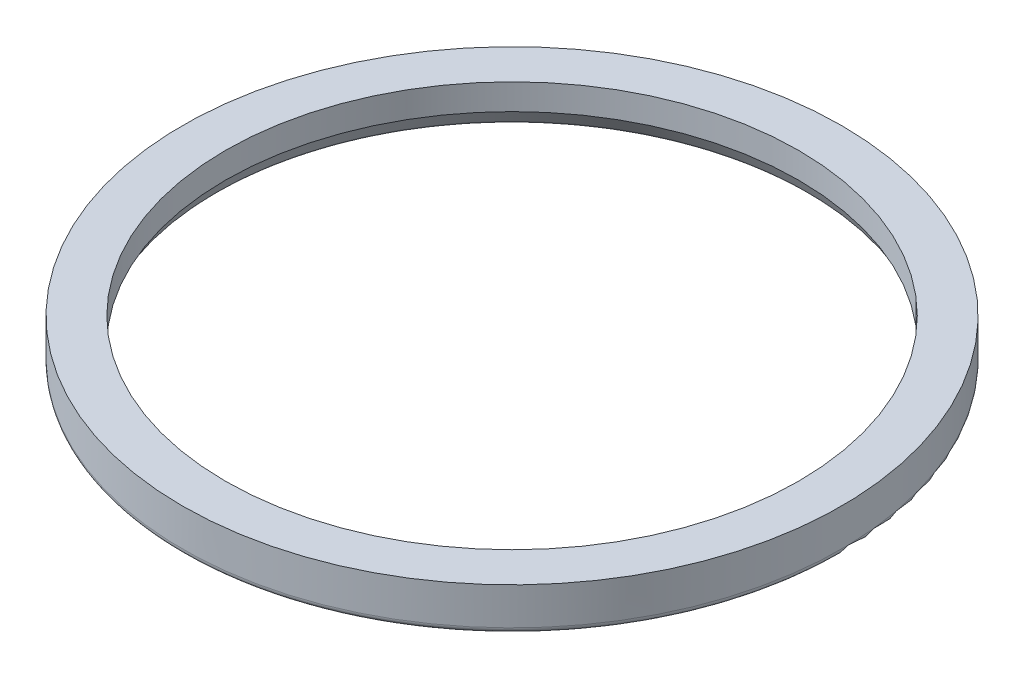
ISO-10303-21;
HEADER;
FILE_DESCRIPTION(('STEP AP214'),'2;1');
FILE_NAME('part.step','',(''),(''),'','','');
FILE_SCHEMA(('AUTOMOTIVE_DESIGN { 1 0 10303 214 1 1 1 1 }'));
ENDSEC;
DATA;
#1=APPLICATION_CONTEXT('core data for automotive mechanical design processes');
#2=APPLICATION_PROTOCOL_DEFINITION('international standard','automotive_design',2000,#1);
#3=PRODUCT_CONTEXT('',#1,'mechanical');
#4=PRODUCT('Part','Part','',(#3));
#5=PRODUCT_RELATED_PRODUCT_CATEGORY('part','',(#4));
#6=PRODUCT_DEFINITION_FORMATION('','',#4);
#7=PRODUCT_DEFINITION_CONTEXT('part definition',#1,'design');
#8=PRODUCT_DEFINITION('design','',#6,#7);
#9=PRODUCT_DEFINITION_SHAPE('','',#8);
#10=(LENGTH_UNIT() NAMED_UNIT(*) SI_UNIT(.MILLI.,.METRE.));
#11=(NAMED_UNIT(*) PLANE_ANGLE_UNIT() SI_UNIT($,.RADIAN.));
#12=(NAMED_UNIT(*) SI_UNIT($,.STERADIAN.) SOLID_ANGLE_UNIT());
#13=UNCERTAINTY_MEASURE_WITH_UNIT(LENGTH_MEASURE(1.E-05),#10,'distance_accuracy_value','');
#14=(GEOMETRIC_REPRESENTATION_CONTEXT(3) GLOBAL_UNCERTAINTY_ASSIGNED_CONTEXT((#13)) GLOBAL_UNIT_ASSIGNED_CONTEXT((#10,
#11,#12)) REPRESENTATION_CONTEXT('',''));
#15=CARTESIAN_POINT('',(0.,0.,0.));
#16=DIRECTION('',(0.,0.,1.));
#17=DIRECTION('',(1.,0.,0.));
#18=AXIS2_PLACEMENT_3D('',#15,#16,#17);
#19=CARTESIAN_POINT('',(0.,-132.,0.));
#20=DIRECTION('',(0.,-1.,0.));
#21=DIRECTION('',(0.,0.,-1.));
#22=AXIS2_PLACEMENT_3D('',#19,#20,#21);
#23=CYLINDRICAL_SURFACE('',#22,115.);
#24=CARTESIAN_POINT('',(0.,-132.,0.));
#25=DIRECTION('',(0.,1.,0.));
#26=DIRECTION('',(0.,0.,-1.));
#27=AXIS2_PLACEMENT_3D('',#24,#25,#26);
#28=CIRCLE('',#27,115.);
#29=CARTESIAN_POINT('',(0.,-132.,115.));
#30=VERTEX_POINT('',#29);
#31=EDGE_CURVE('E27',#30,#30,#28,.T.);
#32=ORIENTED_EDGE('',*,*,#31,.F.);
#33=EDGE_LOOP('',(#32));
#34=FACE_BOUND('',#33,.T.);
#35=CARTESIAN_POINT('',(0.,-145.,0.));
#36=DIRECTION('',(0.,-1.,0.));
#37=DIRECTION('',(-1.,0.,0.));
#38=AXIS2_PLACEMENT_3D('',#35,#36,#37);
#39=CIRCLE('',#38,115.);
#40=CARTESIAN_POINT('',(0.,-145.,-115.));
#41=VERTEX_POINT('',#40);
#42=EDGE_CURVE('E11',#41,#41,#39,.T.);
#43=ORIENTED_EDGE('',*,*,#42,.F.);
#44=EDGE_LOOP('',(#43));
#45=FACE_BOUND('',#44,.T.);
#46=ADVANCED_FACE('F17',(#34,#45),#23,.T.);
#47=CARTESIAN_POINT('',(0.,-145.,0.));
#48=DIRECTION('',(0.,1.,0.));
#49=DIRECTION('',(1.,0.,0.));
#50=AXIS2_PLACEMENT_3D('',#47,#48,#49);
#51=TOROIDAL_SURFACE('',#50,113.,2.);
#52=CARTESIAN_POINT('',(0.,-147.,0.));
#53=DIRECTION('',(0.,1.,0.));
#54=DIRECTION('',(1.,0.,0.));
#55=AXIS2_PLACEMENT_3D('',#52,#53,#54);
#56=CIRCLE('',#55,112.999999943952);
#57=CARTESIAN_POINT('',(-112.999999943952,-147.,0.));
#58=VERTEX_POINT('',#57);
#59=EDGE_CURVE('E94',#58,#58,#56,.T.);
#60=ORIENTED_EDGE('',*,*,#59,.T.);
#61=EDGE_LOOP('',(#60));
#62=FACE_BOUND('',#61,.T.);
#63=ORIENTED_EDGE('',*,*,#42,.T.);
#64=EDGE_LOOP('',(#63));
#65=FACE_BOUND('',#64,.T.);
#66=ADVANCED_FACE('F157',(#62,#65),#51,.T.);
#67=CARTESIAN_POINT('',(-116.38,-132.,116.38));
#68=DIRECTION('',(0.,1.,0.));
#69=DIRECTION('',(1.,0.,0.));
#70=AXIS2_PLACEMENT_3D('',#67,#68,#69);
#71=PLANE('',#70);
#72=CARTESIAN_POINT('',(0.,-132.,0.));
#73=DIRECTION('',(0.,1.,0.));
#74=DIRECTION('',(0.,0.,-1.));
#75=AXIS2_PLACEMENT_3D('',#72,#73,#74);
#76=CIRCLE('',#75,100.);
#77=CARTESIAN_POINT('',(0.,-132.,-100.));
#78=VERTEX_POINT('',#77);
#79=EDGE_CURVE('E89',#78,#78,#76,.T.);
#80=ORIENTED_EDGE('',*,*,#79,.F.);
#81=EDGE_LOOP('',(#80));
#82=FACE_BOUND('',#81,.T.);
#83=ORIENTED_EDGE('',*,*,#31,.T.);
#84=EDGE_LOOP('',(#83));
#85=FACE_BOUND('',#84,.T.);
#86=ADVANCED_FACE('F152',(#82,#85),#71,.T.);
#87=CARTESIAN_POINT('',(104.618802154,-147.,0.));
#88=CARTESIAN_POINT('',(104.618802154,-147.,-209.237604307));
#89=CARTESIAN_POINT('',(-104.618802154,-147.,-209.237604307));
#90=CARTESIAN_POINT('',(-104.618802154,-147.,0.));
#91=CARTESIAN_POINT('',(103.886751346,-147.,0.));
#92=CARTESIAN_POINT('',(103.886751346,-147.,-207.773502692));
#93=CARTESIAN_POINT('',(-103.886751346,-147.,-207.773502692));
#94=CARTESIAN_POINT('',(-103.886751346,-147.,0.));
#95=CARTESIAN_POINT('',(103.25277675,-146.633974596,0.));
#96=CARTESIAN_POINT('',(103.25277675,-146.633974596,-206.505553499));
#97=CARTESIAN_POINT('',(-103.25277675,-146.633974596,-206.505553499));
#98=CARTESIAN_POINT('',(-103.25277675,-146.633974596,0.));
#99=CARTESIAN_POINT('',(102.886751346,-146.,0.));
#100=CARTESIAN_POINT('',(102.886751346,-146.,-205.773502692));
#101=CARTESIAN_POINT('',(-102.886751346,-146.,-205.773502692));
#102=CARTESIAN_POINT('',(-102.886751346,-146.,0.));
#103=(BOUNDED_SURFACE() B_SPLINE_SURFACE(3,3,((#87,#88,#89,#90),(#91,#92,#93,#94),(#95,#96,#97,
#98),(#99,#100,#101,#102)),.UNSPECIFIED.,.F.,.F.,.F.) B_SPLINE_SURFACE_WITH_KNOTS((4,4),(4,4),
(0.,1.),(0.,1.),.UNSPECIFIED.) GEOMETRIC_REPRESENTATION_ITEM() RATIONAL_B_SPLINE_SURFACE(((1.,
0.333333333333333,0.333333333333333,1.),(0.910683602522958,0.303561200840986,0.303561200840986,
0.910683602522958),(0.910683602522958,0.303561200840986,0.303561200840986,0.910683602522958),
(1.,0.333333333333333,0.333333333333333,1.))) REPRESENTATION_ITEM('') SURFACE());
#104=CARTESIAN_POINT('',(-104.618802111082,-147.,0.));
#105=CARTESIAN_POINT('',(-104.618802154,-147.,-209.237604307));
#106=CARTESIAN_POINT('',(104.618802154,-147.,-209.237604307));
#107=CARTESIAN_POINT('',(104.618802111082,-147.,0.));
#108=(BOUNDED_CURVE() B_SPLINE_CURVE(3,(#104,#105,#106,#107),.UNSPECIFIED.,.F.,
.F.) B_SPLINE_CURVE_WITH_KNOTS((4,4),(0.,1.),
.UNSPECIFIED.) CURVE() GEOMETRIC_REPRESENTATION_ITEM() RATIONAL_B_SPLINE_CURVE((1.,
0.333333333333333,0.333333333333333,1.)) REPRESENTATION_ITEM(''));
#109=CARTESIAN_POINT('',(-104.618802111082,-147.,0.));
#110=VERTEX_POINT('',#109);
#111=CARTESIAN_POINT('',(104.618802111082,-147.,0.));
#112=VERTEX_POINT('',#111);
#113=EDGE_CURVE('E82',#110,#112,#108,.T.);
#114=CARTESIAN_POINT('',(104.618802111082,-147.,0.));
#115=CARTESIAN_POINT('',(103.886751346,-147.,0.));
#116=CARTESIAN_POINT('',(103.25277675,-146.633974596,0.));
#117=CARTESIAN_POINT('',(102.886751346,-146.,1.05512127250385E-08));
#118=(BOUNDED_CURVE() B_SPLINE_CURVE(3,(#114,#115,#116,#117),.UNSPECIFIED.,.F.,
.F.) B_SPLINE_CURVE_WITH_KNOTS((4,4),(0.,1.),
.UNSPECIFIED.) CURVE() GEOMETRIC_REPRESENTATION_ITEM() RATIONAL_B_SPLINE_CURVE((1.,
0.910683602522958,0.910683602522958,1.)) REPRESENTATION_ITEM(''));
#119=CARTESIAN_POINT('',(102.886751346,-146.,1.05512127250385E-08));
#120=VERTEX_POINT('',#119);
#121=EDGE_CURVE('E61',#112,#120,#118,.T.);
#122=CARTESIAN_POINT('',(0.,-146.,0.));
#123=DIRECTION('',(0.,1.,0.));
#124=DIRECTION('',(1.,0.,0.));
#125=AXIS2_PLACEMENT_3D('',#122,#123,#124);
#126=CIRCLE('',#125,102.886751346);
#127=CARTESIAN_POINT('',(-102.886751346,-146.,0.));
#128=VERTEX_POINT('',#127);
#129=EDGE_CURVE('E20',#120,#128,#126,.T.);
#130=CARTESIAN_POINT('',(-102.886751346,-146.,0.));
#131=CARTESIAN_POINT('',(-103.25277675,-146.633974596,0.));
#132=CARTESIAN_POINT('',(-103.886751346,-147.,0.));
#133=CARTESIAN_POINT('',(-104.618802111082,-147.,0.));
#134=(BOUNDED_CURVE() B_SPLINE_CURVE(3,(#130,#131,#132,#133),.UNSPECIFIED.,.F.,
.F.) B_SPLINE_CURVE_WITH_KNOTS((4,4),(0.,1.),
.UNSPECIFIED.) CURVE() GEOMETRIC_REPRESENTATION_ITEM() RATIONAL_B_SPLINE_CURVE((1.,
0.910683602522958,0.910683602522958,1.)) REPRESENTATION_ITEM(''));
#135=EDGE_CURVE('E74',#128,#110,#134,.T.);
#136=ORIENTED_EDGE('',*,*,#113,.T.);
#137=ORIENTED_EDGE('',*,*,#121,.T.);
#138=ORIENTED_EDGE('',*,*,#129,.T.);
#139=ORIENTED_EDGE('',*,*,#135,.T.);
#140=EDGE_LOOP('',(#136,#137,#138,#139));
#141=FACE_BOUND('',#140,.T.);
#142=ADVANCED_FACE('F136',(#141),#103,.T.);
#143=CARTESIAN_POINT('',(-114.356,-147.,114.356));
#144=DIRECTION('',(0.,1.,0.));
#145=DIRECTION('',(1.,0.,0.));
#146=AXIS2_PLACEMENT_3D('',#143,#144,#145);
#147=PLANE('',#146);
#148=CARTESIAN_POINT('',(104.618802111082,-147.,0.));
#149=CARTESIAN_POINT('',(104.618802154,-147.,209.237604307));
#150=CARTESIAN_POINT('',(-104.618802154,-147.,209.237604307));
#151=CARTESIAN_POINT('',(-104.618802111082,-147.,0.));
#152=(BOUNDED_CURVE() B_SPLINE_CURVE(3,(#148,#149,#150,#151),.UNSPECIFIED.,.F.,
.F.) B_SPLINE_CURVE_WITH_KNOTS((4,4),(0.,1.),
.UNSPECIFIED.) CURVE() GEOMETRIC_REPRESENTATION_ITEM() RATIONAL_B_SPLINE_CURVE((1.,
0.333333333333333,0.333333333333333,1.)) REPRESENTATION_ITEM(''));
#153=EDGE_CURVE('E102',#112,#110,#152,.T.);
#154=ORIENTED_EDGE('',*,*,#153,.F.);
#155=ORIENTED_EDGE('',*,*,#113,.F.);
#156=EDGE_LOOP('',(#154,#155));
#157=FACE_BOUND('',#156,.T.);
#158=ORIENTED_EDGE('',*,*,#59,.F.);
#159=EDGE_LOOP('',(#158));
#160=FACE_BOUND('',#159,.T.);
#161=ADVANCED_FACE('F137',(#157,#160),#147,.F.);
#162=CARTESIAN_POINT('',(0.,-132.,0.));
#163=DIRECTION('',(0.,-1.,0.));
#164=DIRECTION('',(0.,0.,-1.));
#165=AXIS2_PLACEMENT_3D('',#162,#163,#164);
#166=CYLINDRICAL_SURFACE('',#165,100.);
#167=ORIENTED_EDGE('',*,*,#79,.T.);
#168=EDGE_LOOP('',(#167));
#169=FACE_BOUND('',#168,.T.);
#170=CARTESIAN_POINT('',(0.,-141.,0.));
#171=DIRECTION('',(0.,1.,0.));
#172=DIRECTION('',(-1.,0.,0.));
#173=AXIS2_PLACEMENT_3D('',#170,#171,#172);
#174=CIRCLE('',#173,100.);
#175=CARTESIAN_POINT('',(0.,-141.,-100.));
#176=VERTEX_POINT('',#175);
#177=EDGE_CURVE('E108',#176,#176,#174,.T.);
#178=ORIENTED_EDGE('',*,*,#177,.F.);
#179=EDGE_LOOP('',(#178));
#180=FACE_BOUND('',#179,.T.);
#181=ADVANCED_FACE('F90',(#169,#180),#166,.F.);
#182=CARTESIAN_POINT('',(-104.618802154,-147.,0.));
#183=CARTESIAN_POINT('',(-104.618802154,-147.,209.237604307));
#184=CARTESIAN_POINT('',(104.618802154,-147.,209.237604307));
#185=CARTESIAN_POINT('',(104.618802154,-147.,0.));
#186=CARTESIAN_POINT('',(-103.886751346,-147.,0.));
#187=CARTESIAN_POINT('',(-103.886751346,-147.,207.773502692));
#188=CARTESIAN_POINT('',(103.886751346,-147.,207.773502692));
#189=CARTESIAN_POINT('',(103.886751346,-147.,0.));
#190=CARTESIAN_POINT('',(-103.25277675,-146.633974596,0.));
#191=CARTESIAN_POINT('',(-103.25277675,-146.633974596,206.505553499));
#192=CARTESIAN_POINT('',(103.25277675,-146.633974596,206.505553499));
#193=CARTESIAN_POINT('',(103.25277675,-146.633974596,0.));
#194=CARTESIAN_POINT('',(-102.886751346,-146.,0.));
#195=CARTESIAN_POINT('',(-102.886751346,-146.,205.773502692));
#196=CARTESIAN_POINT('',(102.886751346,-146.,205.773502692));
#197=CARTESIAN_POINT('',(102.886751346,-146.,0.));
#198=(BOUNDED_SURFACE() B_SPLINE_SURFACE(3,3,((#182,#183,#184,#185),(#186,#187,#188,#189),(#190,
#191,#192,#193),(#194,#195,#196,#197)),.UNSPECIFIED.,.F.,.F.,
.F.) B_SPLINE_SURFACE_WITH_KNOTS((4,4),(4,4),(0.,1.),(0.,1.),
.UNSPECIFIED.) GEOMETRIC_REPRESENTATION_ITEM() RATIONAL_B_SPLINE_SURFACE(((1.,0.333333333333333,
0.333333333333333,1.),(0.910683602522958,0.303561200840986,0.303561200840986,0.910683602522958),
(0.910683602522958,0.303561200840986,0.303561200840986,0.910683602522958),(1.,0.333333333333333,
0.333333333333333,1.))) REPRESENTATION_ITEM('') SURFACE());
#199=CARTESIAN_POINT('',(0.,-146.,0.));
#200=DIRECTION('',(0.,1.,0.));
#201=DIRECTION('',(1.,0.,0.));
#202=AXIS2_PLACEMENT_3D('',#199,#200,#201);
#203=CIRCLE('',#202,102.886751346);
#204=EDGE_CURVE('E111',#128,#120,#203,.T.);
#205=ORIENTED_EDGE('',*,*,#121,.F.);
#206=ORIENTED_EDGE('',*,*,#153,.T.);
#207=ORIENTED_EDGE('',*,*,#135,.F.);
#208=ORIENTED_EDGE('',*,*,#204,.T.);
#209=EDGE_LOOP('',(#205,#206,#207,#208));
#210=FACE_BOUND('',#209,.T.);
#211=ADVANCED_FACE('F139',(#210),#198,.T.);
#212=CARTESIAN_POINT('',(0.,-141.,0.));
#213=DIRECTION('',(0.,-1.,0.));
#214=DIRECTION('',(-1.,0.,0.));
#215=AXIS2_PLACEMENT_3D('',#212,#213,#214);
#216=CONICAL_SURFACE('',#215,100.,0.523598775606077);
#217=ORIENTED_EDGE('',*,*,#204,.F.);
#218=ORIENTED_EDGE('',*,*,#129,.F.);
#219=EDGE_LOOP('',(#217,#218));
#220=FACE_BOUND('',#219,.T.);
#221=ORIENTED_EDGE('',*,*,#177,.T.);
#222=EDGE_LOOP('',(#221));
#223=FACE_BOUND('',#222,.T.);
#224=ADVANCED_FACE('F142',(#220,#223),#216,.F.);
#225=CLOSED_SHELL('',(#46,#66,#86,#142,#161,#181,#211,#224));
#226=MANIFOLD_SOLID_BREP('B1',#225);
#227=ADVANCED_BREP_SHAPE_REPRESENTATION('',(#18,#226),#14);
#228=SHAPE_DEFINITION_REPRESENTATION(#9,#227);
ENDSEC;
END-ISO-10303-21;
